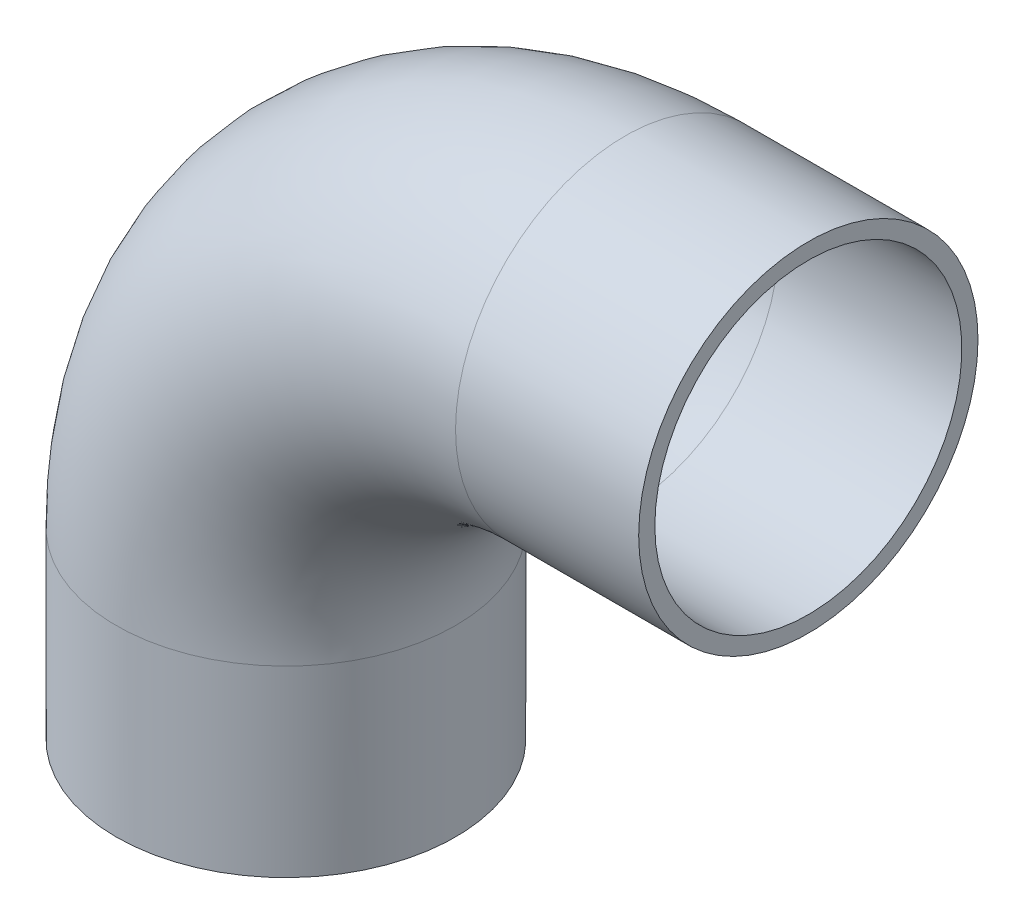
ISO-10303-21;
HEADER;
FILE_DESCRIPTION(('STEP AP214'),'2;1');
FILE_NAME('part.step','',(''),(''),'','','');
FILE_SCHEMA(('AUTOMOTIVE_DESIGN { 1 0 10303 214 1 1 1 1 }'));
ENDSEC;
DATA;
#1=APPLICATION_CONTEXT('core data for automotive mechanical design processes');
#2=APPLICATION_PROTOCOL_DEFINITION('international standard','automotive_design',2000,#1);
#3=PRODUCT_CONTEXT('',#1,'mechanical');
#4=PRODUCT('Part','Part','',(#3));
#5=PRODUCT_RELATED_PRODUCT_CATEGORY('part','',(#4));
#6=PRODUCT_DEFINITION_FORMATION('','',#4);
#7=PRODUCT_DEFINITION_CONTEXT('part definition',#1,'design');
#8=PRODUCT_DEFINITION('design','',#6,#7);
#9=PRODUCT_DEFINITION_SHAPE('','',#8);
#10=(LENGTH_UNIT() NAMED_UNIT(*) SI_UNIT(.MILLI.,.METRE.));
#11=(NAMED_UNIT(*) PLANE_ANGLE_UNIT() SI_UNIT($,.RADIAN.));
#12=(NAMED_UNIT(*) SI_UNIT($,.STERADIAN.) SOLID_ANGLE_UNIT());
#13=UNCERTAINTY_MEASURE_WITH_UNIT(LENGTH_MEASURE(1.E-05),#10,'distance_accuracy_value','');
#14=(GEOMETRIC_REPRESENTATION_CONTEXT(3) GLOBAL_UNCERTAINTY_ASSIGNED_CONTEXT((#13)) GLOBAL_UNIT_ASSIGNED_CONTEXT((#10,
#11,#12)) REPRESENTATION_CONTEXT('',''));
#15=CARTESIAN_POINT('',(0.,0.,0.));
#16=DIRECTION('',(0.,0.,1.));
#17=DIRECTION('',(1.,0.,0.));
#18=AXIS2_PLACEMENT_3D('',#15,#16,#17);
#19=CARTESIAN_POINT('',(63.,34.,0.));
#20=DIRECTION('',(0.,0.,1.));
#21=DIRECTION('',(1.,0.,0.));
#22=AXIS2_PLACEMENT_3D('',#19,#20,#21);
#23=TOROIDAL_SURFACE('',#22,63.,28.5);
#24=CARTESIAN_POINT('',(63.,97.,0.));
#25=DIRECTION('',(-1.,0.,0.));
#26=DIRECTION('',(0.,1.,0.));
#27=AXIS2_PLACEMENT_3D('',#24,#25,#26);
#28=CIRCLE('',#27,28.5);
#29=CARTESIAN_POINT('',(63.,125.5,0.));
#30=VERTEX_POINT('',#29);
#31=EDGE_CURVE('E33',#30,#30,#28,.T.);
#32=ORIENTED_EDGE('',*,*,#31,.F.);
#33=EDGE_LOOP('',(#32));
#34=FACE_BOUND('',#33,.T.);
#35=CARTESIAN_POINT('',(0.,34.,0.));
#36=DIRECTION('',(0.,-1.,0.));
#37=DIRECTION('',(-1.,0.,0.));
#38=AXIS2_PLACEMENT_3D('',#35,#36,#37);
#39=CIRCLE('',#38,28.5);
#40=CARTESIAN_POINT('',(-28.5,34.,0.));
#41=VERTEX_POINT('',#40);
#42=EDGE_CURVE('E31',#41,#41,#39,.F.);
#43=ORIENTED_EDGE('',*,*,#42,.F.);
#44=EDGE_LOOP('',(#43));
#45=FACE_BOUND('',#44,.T.);
#46=ADVANCED_FACE('F13',(#34,#45),#23,.F.);
#47=CARTESIAN_POINT('',(97.,97.,0.));
#48=DIRECTION('',(-1.,0.,0.));
#49=DIRECTION('',(0.,0.,1.));
#50=AXIS2_PLACEMENT_3D('',#47,#48,#49);
#51=CYLINDRICAL_SURFACE('',#50,28.5);
#52=CARTESIAN_POINT('',(97.,97.,0.));
#53=DIRECTION('',(-1.,0.,0.));
#54=DIRECTION('',(0.,0.,1.));
#55=AXIS2_PLACEMENT_3D('',#52,#53,#54);
#56=CIRCLE('',#55,28.5);
#57=CARTESIAN_POINT('',(97.,97.,28.5));
#58=VERTEX_POINT('',#57);
#59=EDGE_CURVE('E17',#58,#58,#56,.T.);
#60=ORIENTED_EDGE('',*,*,#59,.F.);
#61=EDGE_LOOP('',(#60));
#62=FACE_BOUND('',#61,.T.);
#63=ORIENTED_EDGE('',*,*,#31,.T.);
#64=EDGE_LOOP('',(#63));
#65=FACE_BOUND('',#64,.T.);
#66=ADVANCED_FACE('F52',(#62,#65),#51,.F.);
#67=CARTESIAN_POINT('',(0.,34.,0.));
#68=DIRECTION('',(0.,-1.,0.));
#69=DIRECTION('',(0.,0.,-1.));
#70=AXIS2_PLACEMENT_3D('',#67,#68,#69);
#71=CYLINDRICAL_SURFACE('',#70,28.5);
#72=ORIENTED_EDGE('',*,*,#42,.T.);
#73=EDGE_LOOP('',(#72));
#74=FACE_BOUND('',#73,.T.);
#75=CARTESIAN_POINT('',(0.,0.,0.));
#76=DIRECTION('',(0.,-1.,0.));
#77=DIRECTION('',(0.,0.,-1.));
#78=AXIS2_PLACEMENT_3D('',#75,#76,#77);
#79=CIRCLE('',#78,28.5);
#80=CARTESIAN_POINT('',(0.,0.,-28.5));
#81=VERTEX_POINT('',#80);
#82=EDGE_CURVE('E42',#81,#81,#79,.F.);
#83=ORIENTED_EDGE('',*,*,#82,.F.);
#84=EDGE_LOOP('',(#83));
#85=FACE_BOUND('',#84,.T.);
#86=ADVANCED_FACE('F55',(#74,#85),#71,.F.);
#87=CARTESIAN_POINT('',(97.,128.5,31.8780010540613));
#88=DIRECTION('',(1.,0.,0.));
#89=DIRECTION('',(0.,-1.,0.));
#90=AXIS2_PLACEMENT_3D('',#87,#88,#89);
#91=PLANE('',#90);
#92=ORIENTED_EDGE('',*,*,#59,.T.);
#93=EDGE_LOOP('',(#92));
#94=FACE_BOUND('',#93,.T.);
#95=CARTESIAN_POINT('',(97.,97.,0.));
#96=DIRECTION('',(-1.,0.,0.));
#97=DIRECTION('',(0.,0.,1.));
#98=AXIS2_PLACEMENT_3D('',#95,#96,#97);
#99=CIRCLE('',#98,31.5);
#100=CARTESIAN_POINT('',(97.,97.,31.5));
#101=VERTEX_POINT('',#100);
#102=EDGE_CURVE('E40',#101,#101,#99,.T.);
#103=ORIENTED_EDGE('',*,*,#102,.F.);
#104=EDGE_LOOP('',(#103));
#105=FACE_BOUND('',#104,.T.);
#106=ADVANCED_FACE('F49',(#94,#105),#91,.T.);
#107=CARTESIAN_POINT('',(31.5,0.,31.8780010542674));
#108=DIRECTION('',(0.,-1.,0.));
#109=DIRECTION('',(-1.,0.,0.));
#110=AXIS2_PLACEMENT_3D('',#107,#108,#109);
#111=PLANE('',#110);
#112=ORIENTED_EDGE('',*,*,#82,.T.);
#113=EDGE_LOOP('',(#112));
#114=FACE_BOUND('',#113,.T.);
#115=CARTESIAN_POINT('',(0.,0.,0.));
#116=DIRECTION('',(0.,-1.,0.));
#117=DIRECTION('',(0.,0.,-1.));
#118=AXIS2_PLACEMENT_3D('',#115,#116,#117);
#119=CIRCLE('',#118,31.5);
#120=CARTESIAN_POINT('',(0.,0.,-31.5));
#121=VERTEX_POINT('',#120);
#122=EDGE_CURVE('E26',#121,#121,#119,.F.);
#123=ORIENTED_EDGE('',*,*,#122,.F.);
#124=EDGE_LOOP('',(#123));
#125=FACE_BOUND('',#124,.T.);
#126=ADVANCED_FACE('F69',(#114,#125),#111,.T.);
#127=CARTESIAN_POINT('',(63.,97.,0.));
#128=DIRECTION('',(-1.,0.,0.));
#129=DIRECTION('',(0.,0.,1.));
#130=AXIS2_PLACEMENT_3D('',#127,#128,#129);
#131=CYLINDRICAL_SURFACE('',#130,31.5);
#132=ORIENTED_EDGE('',*,*,#102,.T.);
#133=EDGE_LOOP('',(#132));
#134=FACE_BOUND('',#133,.T.);
#135=CARTESIAN_POINT('',(63.,97.,0.));
#136=DIRECTION('',(-1.,0.,0.));
#137=DIRECTION('',(0.,-1.,0.));
#138=AXIS2_PLACEMENT_3D('',#135,#136,#137);
#139=CIRCLE('',#138,31.5);
#140=CARTESIAN_POINT('',(63.,65.5,0.));
#141=VERTEX_POINT('',#140);
#142=EDGE_CURVE('E21',#141,#141,#139,.T.);
#143=ORIENTED_EDGE('',*,*,#142,.F.);
#144=EDGE_LOOP('',(#143));
#145=FACE_BOUND('',#144,.T.);
#146=ADVANCED_FACE('F79',(#134,#145),#131,.T.);
#147=CARTESIAN_POINT('',(0.,0.,0.));
#148=DIRECTION('',(0.,-1.,0.));
#149=DIRECTION('',(0.,0.,-1.));
#150=AXIS2_PLACEMENT_3D('',#147,#148,#149);
#151=CYLINDRICAL_SURFACE('',#150,31.5);
#152=CARTESIAN_POINT('',(0.,34.,0.));
#153=DIRECTION('',(0.,-1.,0.));
#154=DIRECTION('',(1.,0.,0.));
#155=AXIS2_PLACEMENT_3D('',#152,#153,#154);
#156=CIRCLE('',#155,31.5);
#157=CARTESIAN_POINT('',(31.5,34.,0.));
#158=VERTEX_POINT('',#157);
#159=EDGE_CURVE('E8',#158,#158,#156,.F.);
#160=ORIENTED_EDGE('',*,*,#159,.F.);
#161=EDGE_LOOP('',(#160));
#162=FACE_BOUND('',#161,.T.);
#163=ORIENTED_EDGE('',*,*,#122,.T.);
#164=EDGE_LOOP('',(#163));
#165=FACE_BOUND('',#164,.T.);
#166=ADVANCED_FACE('F73',(#162,#165),#151,.T.);
#167=CARTESIAN_POINT('',(63.,34.,0.));
#168=DIRECTION('',(0.,0.,1.));
#169=DIRECTION('',(1.,0.,0.));
#170=AXIS2_PLACEMENT_3D('',#167,#168,#169);
#171=TOROIDAL_SURFACE('',#170,63.,31.5);
#172=ORIENTED_EDGE('',*,*,#142,.T.);
#173=EDGE_LOOP('',(#172));
#174=FACE_BOUND('',#173,.T.);
#175=ORIENTED_EDGE('',*,*,#159,.T.);
#176=EDGE_LOOP('',(#175));
#177=FACE_BOUND('',#176,.T.);
#178=ADVANCED_FACE('F71',(#174,#177),#171,.T.);
#179=CLOSED_SHELL('',(#46,#66,#86,#106,#126,#146,#166,#178));
#180=MANIFOLD_SOLID_BREP('B1',#179);
#181=ADVANCED_BREP_SHAPE_REPRESENTATION('',(#18,#180),#14);
#182=SHAPE_DEFINITION_REPRESENTATION(#9,#181);
ENDSEC;
END-ISO-10303-21;
